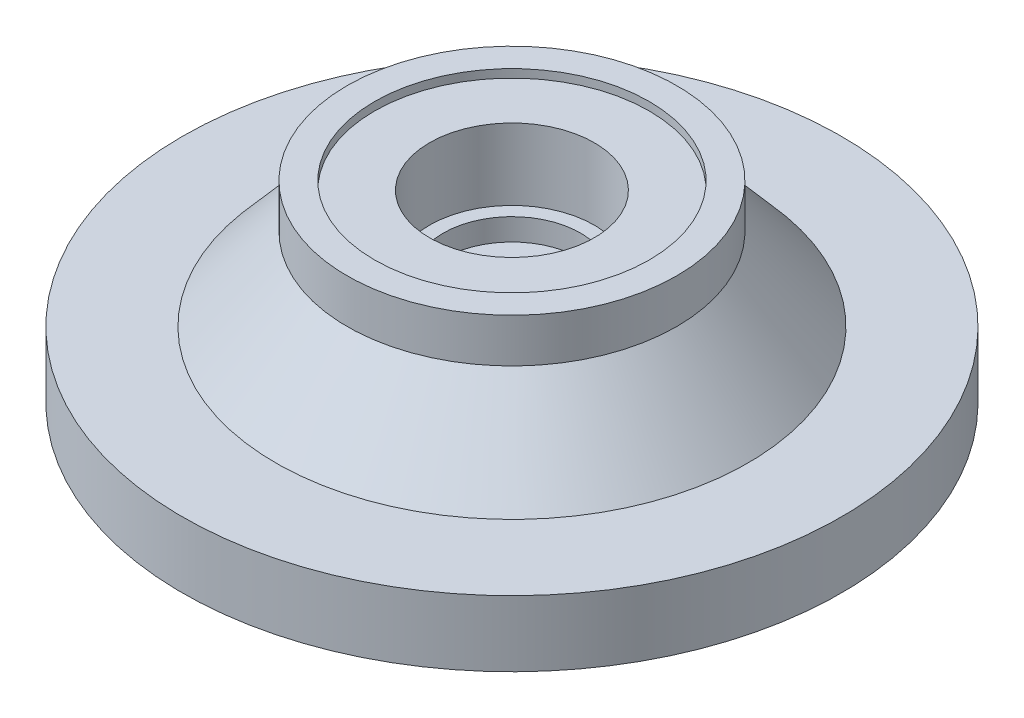
ISO-10303-21;
HEADER;
FILE_DESCRIPTION(('STEP AP214'),'2;1');
FILE_NAME('part.step','',(''),(''),'','','');
FILE_SCHEMA(('AUTOMOTIVE_DESIGN { 1 0 10303 214 1 1 1 1 }'));
ENDSEC;
DATA;
#1=APPLICATION_CONTEXT('core data for automotive mechanical design processes');
#2=APPLICATION_PROTOCOL_DEFINITION('international standard','automotive_design',2000,#1);
#3=PRODUCT_CONTEXT('',#1,'mechanical');
#4=PRODUCT('Part','Part','',(#3));
#5=PRODUCT_RELATED_PRODUCT_CATEGORY('part','',(#4));
#6=PRODUCT_DEFINITION_FORMATION('','',#4);
#7=PRODUCT_DEFINITION_CONTEXT('part definition',#1,'design');
#8=PRODUCT_DEFINITION('design','',#6,#7);
#9=PRODUCT_DEFINITION_SHAPE('','',#8);
#10=(LENGTH_UNIT() NAMED_UNIT(*) SI_UNIT(.MILLI.,.METRE.));
#11=(NAMED_UNIT(*) PLANE_ANGLE_UNIT() SI_UNIT($,.RADIAN.));
#12=(NAMED_UNIT(*) SI_UNIT($,.STERADIAN.) SOLID_ANGLE_UNIT());
#13=UNCERTAINTY_MEASURE_WITH_UNIT(LENGTH_MEASURE(1.E-05),#10,'distance_accuracy_value','');
#14=(GEOMETRIC_REPRESENTATION_CONTEXT(3) GLOBAL_UNCERTAINTY_ASSIGNED_CONTEXT((#13)) GLOBAL_UNIT_ASSIGNED_CONTEXT((#10,
#11,#12)) REPRESENTATION_CONTEXT('',''));
#15=CARTESIAN_POINT('',(0.,0.,0.));
#16=DIRECTION('',(0.,0.,1.));
#17=DIRECTION('',(1.,0.,0.));
#18=AXIS2_PLACEMENT_3D('',#15,#16,#17);
#19=CARTESIAN_POINT('',(0.,0.,0.));
#20=DIRECTION('',(0.,1.,0.));
#21=DIRECTION('',(-1.,0.,0.));
#22=AXIS2_PLACEMENT_3D('',#19,#20,#21);
#23=PLANE('',#22);
#24=CARTESIAN_POINT('',(0.,0.,0.));
#25=DIRECTION('',(0.,-1.,0.));
#26=DIRECTION('',(1.,0.,0.));
#27=AXIS2_PLACEMENT_3D('',#24,#25,#26);
#28=CIRCLE('',#27,43.);
#29=CARTESIAN_POINT('',(43.,0.,0.));
#30=VERTEX_POINT('',#29);
#31=EDGE_CURVE('E110',#30,#30,#28,.T.);
#32=ORIENTED_EDGE('',*,*,#31,.F.);
#33=EDGE_LOOP('',(#32));
#34=FACE_BOUND('',#33,.T.);
#35=CARTESIAN_POINT('',(0.,0.,0.));
#36=DIRECTION('',(0.,1.,0.));
#37=DIRECTION('',(-1.,0.,0.));
#38=AXIS2_PLACEMENT_3D('',#35,#36,#37);
#39=CIRCLE('',#38,60.);
#40=CARTESIAN_POINT('',(-60.,0.,0.));
#41=VERTEX_POINT('',#40);
#42=EDGE_CURVE('E10',#41,#41,#39,.T.);
#43=ORIENTED_EDGE('',*,*,#42,.F.);
#44=EDGE_LOOP('',(#43));
#45=FACE_BOUND('',#44,.T.);
#46=ADVANCED_FACE('F45',(#34,#45),#23,.F.);
#47=CARTESIAN_POINT('',(0.,35.,0.));
#48=DIRECTION('',(0.,1.,0.));
#49=DIRECTION('',(-1.,0.,0.));
#50=AXIS2_PLACEMENT_3D('',#47,#48,#49);
#51=CYLINDRICAL_SURFACE('',#50,60.);
#52=CARTESIAN_POINT('',(0.,12.,0.));
#53=DIRECTION('',(0.,1.,0.));
#54=DIRECTION('',(-1.,0.,0.));
#55=AXIS2_PLACEMENT_3D('',#52,#53,#54);
#56=CIRCLE('',#55,60.);
#57=CARTESIAN_POINT('',(-60.,12.,0.));
#58=VERTEX_POINT('',#57);
#59=EDGE_CURVE('E53',#58,#58,#56,.T.);
#60=ORIENTED_EDGE('',*,*,#59,.F.);
#61=EDGE_LOOP('',(#60));
#62=FACE_BOUND('',#61,.T.);
#63=ORIENTED_EDGE('',*,*,#42,.T.);
#64=EDGE_LOOP('',(#63));
#65=FACE_BOUND('',#64,.T.);
#66=ADVANCED_FACE('F130',(#62,#65),#51,.T.);
#67=CARTESIAN_POINT('',(60.,12.,0.));
#68=DIRECTION('',(0.,-1.,0.));
#69=DIRECTION('',(1.,0.,0.));
#70=AXIS2_PLACEMENT_3D('',#67,#68,#69);
#71=PLANE('',#70);
#72=CARTESIAN_POINT('',(0.,12.,0.));
#73=DIRECTION('',(0.,1.,0.));
#74=DIRECTION('',(-1.,0.,0.));
#75=AXIS2_PLACEMENT_3D('',#72,#73,#74);
#76=CIRCLE('',#75,43.);
#77=CARTESIAN_POINT('',(-43.,12.,0.));
#78=VERTEX_POINT('',#77);
#79=EDGE_CURVE('E59',#78,#78,#76,.T.);
#80=ORIENTED_EDGE('',*,*,#79,.F.);
#81=EDGE_LOOP('',(#80));
#82=FACE_BOUND('',#81,.T.);
#83=ORIENTED_EDGE('',*,*,#59,.T.);
#84=EDGE_LOOP('',(#83));
#85=FACE_BOUND('',#84,.T.);
#86=ADVANCED_FACE('F127',(#82,#85),#71,.F.);
#87=CARTESIAN_POINT('',(0.,12.,0.));
#88=DIRECTION('',(0.,-1.,0.));
#89=DIRECTION('',(1.,0.,0.));
#90=AXIS2_PLACEMENT_3D('',#87,#88,#89);
#91=CONICAL_SURFACE('',#90,43.,0.714090698612157);
#92=CARTESIAN_POINT('',(0.,27.,0.));
#93=DIRECTION('',(0.,1.,0.));
#94=DIRECTION('',(-1.,0.,0.));
#95=AXIS2_PLACEMENT_3D('',#92,#93,#94);
#96=CIRCLE('',#95,30.);
#97=CARTESIAN_POINT('',(-30.,27.,0.));
#98=VERTEX_POINT('',#97);
#99=EDGE_CURVE('E118',#98,#98,#96,.T.);
#100=ORIENTED_EDGE('',*,*,#99,.F.);
#101=EDGE_LOOP('',(#100));
#102=FACE_BOUND('',#101,.T.);
#103=ORIENTED_EDGE('',*,*,#79,.T.);
#104=EDGE_LOOP('',(#103));
#105=FACE_BOUND('',#104,.T.);
#106=ADVANCED_FACE('F125',(#102,#105),#91,.T.);
#107=CARTESIAN_POINT('',(0.,35.,0.));
#108=DIRECTION('',(0.,1.,0.));
#109=DIRECTION('',(-1.,0.,0.));
#110=AXIS2_PLACEMENT_3D('',#107,#108,#109);
#111=CYLINDRICAL_SURFACE('',#110,30.);
#112=CARTESIAN_POINT('',(0.,35.,0.));
#113=DIRECTION('',(0.,1.,0.));
#114=DIRECTION('',(-1.,0.,0.));
#115=AXIS2_PLACEMENT_3D('',#112,#113,#114);
#116=CIRCLE('',#115,30.);
#117=CARTESIAN_POINT('',(-30.,35.,0.));
#118=VERTEX_POINT('',#117);
#119=EDGE_CURVE('E114',#118,#118,#116,.T.);
#120=ORIENTED_EDGE('',*,*,#119,.F.);
#121=EDGE_LOOP('',(#120));
#122=FACE_BOUND('',#121,.T.);
#123=ORIENTED_EDGE('',*,*,#99,.T.);
#124=EDGE_LOOP('',(#123));
#125=FACE_BOUND('',#124,.T.);
#126=ADVANCED_FACE('F142',(#122,#125),#111,.T.);
#127=CARTESIAN_POINT('',(30.,35.,0.));
#128=DIRECTION('',(0.,-1.,0.));
#129=DIRECTION('',(1.,0.,0.));
#130=AXIS2_PLACEMENT_3D('',#127,#128,#129);
#131=PLANE('',#130);
#132=CARTESIAN_POINT('',(0.,35.,0.));
#133=DIRECTION('',(0.,1.,0.));
#134=DIRECTION('',(-1.,0.,0.));
#135=AXIS2_PLACEMENT_3D('',#132,#133,#134);
#136=CIRCLE('',#135,25.);
#137=CARTESIAN_POINT('',(-25.,35.,0.));
#138=VERTEX_POINT('',#137);
#139=EDGE_CURVE('E85',#138,#138,#136,.T.);
#140=ORIENTED_EDGE('',*,*,#139,.F.);
#141=EDGE_LOOP('',(#140));
#142=FACE_BOUND('',#141,.T.);
#143=ORIENTED_EDGE('',*,*,#119,.T.);
#144=EDGE_LOOP('',(#143));
#145=FACE_BOUND('',#144,.T.);
#146=ADVANCED_FACE('F146',(#142,#145),#131,.F.);
#147=CARTESIAN_POINT('',(0.,2.,0.));
#148=DIRECTION('',(0.,-1.,0.));
#149=DIRECTION('',(0.,0.,-1.));
#150=AXIS2_PLACEMENT_3D('',#147,#148,#149);
#151=CONICAL_SURFACE('',#150,40.,0.982793723247328);
#152=ORIENTED_EDGE('',*,*,#31,.T.);
#153=EDGE_LOOP('',(#152));
#154=FACE_BOUND('',#153,.T.);
#155=CARTESIAN_POINT('',(0.,2.,0.));
#156=DIRECTION('',(0.,-1.,0.));
#157=DIRECTION('',(0.,0.,-1.));
#158=AXIS2_PLACEMENT_3D('',#155,#156,#157);
#159=CIRCLE('',#158,40.);
#160=CARTESIAN_POINT('',(0.,2.,-40.));
#161=VERTEX_POINT('',#160);
#162=EDGE_CURVE('E106',#161,#161,#159,.T.);
#163=ORIENTED_EDGE('',*,*,#162,.F.);
#164=EDGE_LOOP('',(#163));
#165=FACE_BOUND('',#164,.T.);
#166=ADVANCED_FACE('F150',(#154,#165),#151,.F.);
#167=CARTESIAN_POINT('',(0.,5.,0.));
#168=DIRECTION('',(0.,-1.,0.));
#169=DIRECTION('',(1.,0.,0.));
#170=AXIS2_PLACEMENT_3D('',#167,#168,#169);
#171=CYLINDRICAL_SURFACE('',#170,40.);
#172=CARTESIAN_POINT('',(0.,5.,0.));
#173=DIRECTION('',(0.,-1.,0.));
#174=DIRECTION('',(0.,0.,-1.));
#175=AXIS2_PLACEMENT_3D('',#172,#173,#174);
#176=CIRCLE('',#175,40.);
#177=CARTESIAN_POINT('',(0.,5.,-40.));
#178=VERTEX_POINT('',#177);
#179=EDGE_CURVE('E99',#178,#178,#176,.T.);
#180=ORIENTED_EDGE('',*,*,#179,.F.);
#181=EDGE_LOOP('',(#180));
#182=FACE_BOUND('',#181,.T.);
#183=ORIENTED_EDGE('',*,*,#162,.T.);
#184=EDGE_LOOP('',(#183));
#185=FACE_BOUND('',#184,.T.);
#186=ADVANCED_FACE('F152',(#182,#185),#171,.F.);
#187=CARTESIAN_POINT('',(0.,13.5,0.));
#188=DIRECTION('',(0.,-1.,0.));
#189=DIRECTION('',(0.,0.,-1.));
#190=AXIS2_PLACEMENT_3D('',#187,#188,#189);
#191=CONICAL_SURFACE('',#190,30.,0.866302262552679);
#192=ORIENTED_EDGE('',*,*,#179,.T.);
#193=EDGE_LOOP('',(#192));
#194=FACE_BOUND('',#193,.T.);
#195=CARTESIAN_POINT('',(0.,13.5,0.));
#196=DIRECTION('',(0.,-1.,0.));
#197=DIRECTION('',(1.,0.,0.));
#198=AXIS2_PLACEMENT_3D('',#195,#196,#197);
#199=CIRCLE('',#198,30.);
#200=CARTESIAN_POINT('',(30.,13.5,0.));
#201=VERTEX_POINT('',#200);
#202=EDGE_CURVE('E91',#201,#201,#199,.T.);
#203=ORIENTED_EDGE('',*,*,#202,.F.);
#204=EDGE_LOOP('',(#203));
#205=FACE_BOUND('',#204,.T.);
#206=ADVANCED_FACE('F155',(#194,#205),#191,.F.);
#207=CARTESIAN_POINT('',(0.,14.5,0.));
#208=DIRECTION('',(0.,-1.,0.));
#209=DIRECTION('',(1.,0.,0.));
#210=AXIS2_PLACEMENT_3D('',#207,#208,#209);
#211=CYLINDRICAL_SURFACE('',#210,30.);
#212=CARTESIAN_POINT('',(0.,14.5,0.));
#213=DIRECTION('',(0.,-1.,0.));
#214=DIRECTION('',(1.,0.,0.));
#215=AXIS2_PLACEMENT_3D('',#212,#213,#214);
#216=CIRCLE('',#215,30.);
#217=CARTESIAN_POINT('',(30.,14.5,0.));
#218=VERTEX_POINT('',#217);
#219=EDGE_CURVE('E95',#218,#218,#216,.T.);
#220=ORIENTED_EDGE('',*,*,#219,.F.);
#221=EDGE_LOOP('',(#220));
#222=FACE_BOUND('',#221,.T.);
#223=ORIENTED_EDGE('',*,*,#202,.T.);
#224=EDGE_LOOP('',(#223));
#225=FACE_BOUND('',#224,.T.);
#226=ADVANCED_FACE('F162',(#222,#225),#211,.F.);
#227=CARTESIAN_POINT('',(0.,14.5,0.));
#228=DIRECTION('',(0.,-1.,0.));
#229=DIRECTION('',(1.,0.,0.));
#230=AXIS2_PLACEMENT_3D('',#227,#228,#229);
#231=PLANE('',#230);
#232=CARTESIAN_POINT('',(0.,14.5,0.));
#233=DIRECTION('',(0.,-1.,0.));
#234=DIRECTION('',(1.,0.,0.));
#235=AXIS2_PLACEMENT_3D('',#232,#233,#234);
#236=CIRCLE('',#235,9.);
#237=CARTESIAN_POINT('',(9.,14.5,0.));
#238=VERTEX_POINT('',#237);
#239=EDGE_CURVE('E75',#238,#238,#236,.T.);
#240=ORIENTED_EDGE('',*,*,#239,.F.);
#241=EDGE_LOOP('',(#240));
#242=FACE_BOUND('',#241,.T.);
#243=ORIENTED_EDGE('',*,*,#219,.T.);
#244=EDGE_LOOP('',(#243));
#245=FACE_BOUND('',#244,.T.);
#246=ADVANCED_FACE('F166',(#242,#245),#231,.T.);
#247=CARTESIAN_POINT('',(0.,33.5,0.));
#248=DIRECTION('',(0.,1.,0.));
#249=DIRECTION('',(-1.,0.,0.));
#250=AXIS2_PLACEMENT_3D('',#247,#248,#249);
#251=CYLINDRICAL_SURFACE('',#250,25.);
#252=CARTESIAN_POINT('',(0.,33.5,0.));
#253=DIRECTION('',(0.,1.,0.));
#254=DIRECTION('',(-1.,0.,0.));
#255=AXIS2_PLACEMENT_3D('',#252,#253,#254);
#256=CIRCLE('',#255,25.);
#257=CARTESIAN_POINT('',(-25.,33.5,0.));
#258=VERTEX_POINT('',#257);
#259=EDGE_CURVE('E87',#258,#258,#256,.T.);
#260=ORIENTED_EDGE('',*,*,#259,.F.);
#261=EDGE_LOOP('',(#260));
#262=FACE_BOUND('',#261,.T.);
#263=ORIENTED_EDGE('',*,*,#139,.T.);
#264=EDGE_LOOP('',(#263));
#265=FACE_BOUND('',#264,.T.);
#266=ADVANCED_FACE('F170',(#262,#265),#251,.F.);
#267=CARTESIAN_POINT('',(0.,33.5,0.));
#268=DIRECTION('',(0.,1.,0.));
#269=DIRECTION('',(-1.,0.,0.));
#270=AXIS2_PLACEMENT_3D('',#267,#268,#269);
#271=PLANE('',#270);
#272=CARTESIAN_POINT('',(0.,33.5,0.));
#273=DIRECTION('',(0.,1.,0.));
#274=DIRECTION('',(-1.,0.,0.));
#275=AXIS2_PLACEMENT_3D('',#272,#273,#274);
#276=CIRCLE('',#275,15.);
#277=CARTESIAN_POINT('',(-15.,33.5,0.));
#278=VERTEX_POINT('',#277);
#279=EDGE_CURVE('E65',#278,#278,#276,.T.);
#280=ORIENTED_EDGE('',*,*,#279,.F.);
#281=EDGE_LOOP('',(#280));
#282=FACE_BOUND('',#281,.T.);
#283=ORIENTED_EDGE('',*,*,#259,.T.);
#284=EDGE_LOOP('',(#283));
#285=FACE_BOUND('',#284,.T.);
#286=ADVANCED_FACE('F174',(#282,#285),#271,.T.);
#287=CARTESIAN_POINT('',(0.,20.5,0.));
#288=DIRECTION('',(0.,1.,0.));
#289=DIRECTION('',(-1.,0.,0.));
#290=AXIS2_PLACEMENT_3D('',#287,#288,#289);
#291=CYLINDRICAL_SURFACE('',#290,15.);
#292=CARTESIAN_POINT('',(0.,20.5,0.));
#293=DIRECTION('',(0.,1.,0.));
#294=DIRECTION('',(-1.,0.,0.));
#295=AXIS2_PLACEMENT_3D('',#292,#293,#294);
#296=CIRCLE('',#295,15.);
#297=CARTESIAN_POINT('',(-15.,20.5,0.));
#298=VERTEX_POINT('',#297);
#299=EDGE_CURVE('E72',#298,#298,#296,.T.);
#300=ORIENTED_EDGE('',*,*,#299,.F.);
#301=EDGE_LOOP('',(#300));
#302=FACE_BOUND('',#301,.T.);
#303=ORIENTED_EDGE('',*,*,#279,.T.);
#304=EDGE_LOOP('',(#303));
#305=FACE_BOUND('',#304,.T.);
#306=ADVANCED_FACE('F178',(#302,#305),#291,.F.);
#307=CARTESIAN_POINT('',(0.,20.5,0.));
#308=DIRECTION('',(0.,1.,0.));
#309=DIRECTION('',(-1.,0.,0.));
#310=AXIS2_PLACEMENT_3D('',#307,#308,#309);
#311=PLANE('',#310);
#312=CARTESIAN_POINT('',(0.,20.5,0.));
#313=DIRECTION('',(0.,1.,0.));
#314=DIRECTION('',(-1.,0.,0.));
#315=AXIS2_PLACEMENT_3D('',#312,#313,#314);
#316=CIRCLE('',#315,12.5);
#317=CARTESIAN_POINT('',(-12.5,20.5,0.));
#318=VERTEX_POINT('',#317);
#319=EDGE_CURVE('E62',#318,#318,#316,.T.);
#320=ORIENTED_EDGE('',*,*,#319,.F.);
#321=EDGE_LOOP('',(#320));
#322=FACE_BOUND('',#321,.T.);
#323=ORIENTED_EDGE('',*,*,#299,.T.);
#324=EDGE_LOOP('',(#323));
#325=FACE_BOUND('',#324,.T.);
#326=ADVANCED_FACE('F182',(#322,#325),#311,.T.);
#327=CARTESIAN_POINT('',(0.,16.5,0.));
#328=DIRECTION('',(0.,1.,0.));
#329=DIRECTION('',(-1.,0.,0.));
#330=AXIS2_PLACEMENT_3D('',#327,#328,#329);
#331=CYLINDRICAL_SURFACE('',#330,12.5);
#332=ORIENTED_EDGE('',*,*,#319,.T.);
#333=EDGE_LOOP('',(#332));
#334=FACE_BOUND('',#333,.T.);
#335=CARTESIAN_POINT('',(0.,16.5,0.));
#336=DIRECTION('',(0.,1.,0.));
#337=DIRECTION('',(-1.,0.,0.));
#338=AXIS2_PLACEMENT_3D('',#335,#336,#337);
#339=CIRCLE('',#338,12.5);
#340=CARTESIAN_POINT('',(-12.5,16.5,0.));
#341=VERTEX_POINT('',#340);
#342=EDGE_CURVE('E66',#341,#341,#339,.T.);
#343=ORIENTED_EDGE('',*,*,#342,.F.);
#344=EDGE_LOOP('',(#343));
#345=FACE_BOUND('',#344,.T.);
#346=ADVANCED_FACE('F186',(#334,#345),#331,.F.);
#347=CARTESIAN_POINT('',(0.,16.5,0.));
#348=DIRECTION('',(0.,1.,0.));
#349=DIRECTION('',(-1.,0.,0.));
#350=AXIS2_PLACEMENT_3D('',#347,#348,#349);
#351=PLANE('',#350);
#352=CARTESIAN_POINT('',(0.,16.5,0.));
#353=DIRECTION('',(0.,1.,0.));
#354=DIRECTION('',(-1.,0.,0.));
#355=AXIS2_PLACEMENT_3D('',#352,#353,#354);
#356=CIRCLE('',#355,9.);
#357=CARTESIAN_POINT('',(-9.,16.5,0.));
#358=VERTEX_POINT('',#357);
#359=EDGE_CURVE('E48',#358,#358,#356,.T.);
#360=ORIENTED_EDGE('',*,*,#359,.F.);
#361=EDGE_LOOP('',(#360));
#362=FACE_BOUND('',#361,.T.);
#363=ORIENTED_EDGE('',*,*,#342,.T.);
#364=EDGE_LOOP('',(#363));
#365=FACE_BOUND('',#364,.T.);
#366=ADVANCED_FACE('F190',(#362,#365),#351,.T.);
#367=CARTESIAN_POINT('',(0.,12.5,0.));
#368=DIRECTION('',(0.,1.,0.));
#369=DIRECTION('',(-1.,0.,0.));
#370=AXIS2_PLACEMENT_3D('',#367,#368,#369);
#371=CYLINDRICAL_SURFACE('',#370,9.);
#372=ORIENTED_EDGE('',*,*,#239,.T.);
#373=EDGE_LOOP('',(#372));
#374=FACE_BOUND('',#373,.T.);
#375=ORIENTED_EDGE('',*,*,#359,.T.);
#376=EDGE_LOOP('',(#375));
#377=FACE_BOUND('',#376,.T.);
#378=ADVANCED_FACE('F193',(#374,#377),#371,.F.);
#379=CLOSED_SHELL('',(#46,#66,#86,#106,#126,#146,#166,#186,#206,#226,#246,#266,#286,#306,#326,
#346,#366,#378));
#380=MANIFOLD_SOLID_BREP('B2',#379);
#381=ADVANCED_BREP_SHAPE_REPRESENTATION('',(#18,#380),#14);
#382=SHAPE_DEFINITION_REPRESENTATION(#9,#381);
ENDSEC;
END-ISO-10303-21;
